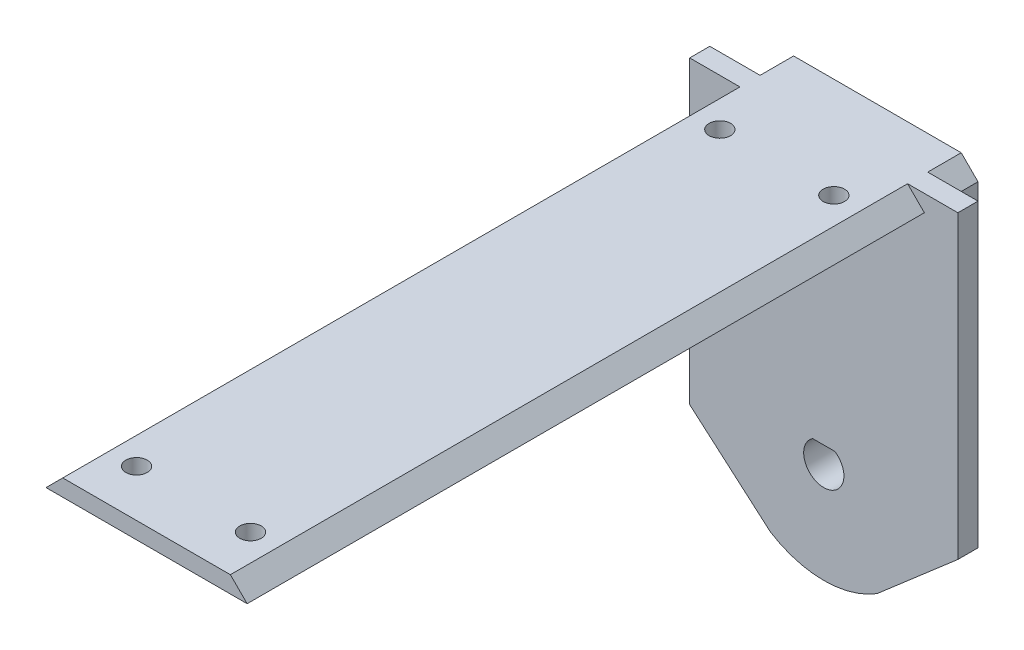
ISO-10303-21;
HEADER;
FILE_DESCRIPTION(('STEP AP214'),'2;1');
FILE_NAME('part.step','',(''),(''),'','','');
FILE_SCHEMA(('AUTOMOTIVE_DESIGN { 1 0 10303 214 1 1 1 1 }'));
ENDSEC;
DATA;
#1=APPLICATION_CONTEXT('core data for automotive mechanical design processes');
#2=APPLICATION_PROTOCOL_DEFINITION('international standard','automotive_design',2000,#1);
#3=PRODUCT_CONTEXT('',#1,'mechanical');
#4=PRODUCT('Part','Part','',(#3));
#5=PRODUCT_RELATED_PRODUCT_CATEGORY('part','',(#4));
#6=PRODUCT_DEFINITION_FORMATION('','',#4);
#7=PRODUCT_DEFINITION_CONTEXT('part definition',#1,'design');
#8=PRODUCT_DEFINITION('design','',#6,#7);
#9=PRODUCT_DEFINITION_SHAPE('','',#8);
#10=(LENGTH_UNIT() NAMED_UNIT(*) SI_UNIT(.MILLI.,.METRE.));
#11=(NAMED_UNIT(*) PLANE_ANGLE_UNIT() SI_UNIT($,.RADIAN.));
#12=(NAMED_UNIT(*) SI_UNIT($,.STERADIAN.) SOLID_ANGLE_UNIT());
#13=UNCERTAINTY_MEASURE_WITH_UNIT(LENGTH_MEASURE(1.E-05),#10,'distance_accuracy_value','');
#14=(GEOMETRIC_REPRESENTATION_CONTEXT(3) GLOBAL_UNCERTAINTY_ASSIGNED_CONTEXT((#13)) GLOBAL_UNIT_ASSIGNED_CONTEXT((#10,
#11,#12)) REPRESENTATION_CONTEXT('',''));
#15=CARTESIAN_POINT('',(0.,0.,0.));
#16=DIRECTION('',(0.,0.,1.));
#17=DIRECTION('',(1.,0.,0.));
#18=AXIS2_PLACEMENT_3D('',#15,#16,#17);
#19=CARTESIAN_POINT('',(0.,-7.,8.));
#20=DIRECTION('',(0.,0.,-1.));
#21=DIRECTION('',(-1.,0.,0.));
#22=AXIS2_PLACEMENT_3D('',#19,#20,#21);
#23=CYLINDRICAL_SURFACE('',#22,10.);
#24=DIRECTION('',(0.,0.,-1.));
#25=VECTOR('',#24,1.);
#26=CARTESIAN_POINT('',(5.,-15.6602540378444,8.));
#27=LINE('',#26,#25);
#28=CARTESIAN_POINT('',(5.,-15.6602540378444,5.));
#29=VERTEX_POINT('',#28);
#30=CARTESIAN_POINT('',(5.,-15.6602540378444,0.));
#31=VERTEX_POINT('',#30);
#32=EDGE_CURVE('E93',#29,#31,#27,.T.);
#33=ORIENTED_EDGE('',*,*,#32,.F.);
#34=CARTESIAN_POINT('',(0.,-7.,5.));
#35=DIRECTION('',(0.,0.,1.));
#36=DIRECTION('',(1.,0.,0.));
#37=AXIS2_PLACEMENT_3D('',#34,#35,#36);
#38=CIRCLE('',#37,10.);
#39=CARTESIAN_POINT('',(-5.,-15.6602540378444,5.));
#40=VERTEX_POINT('',#39);
#41=EDGE_CURVE('E320',#29,#40,#38,.F.);
#42=ORIENTED_EDGE('',*,*,#41,.T.);
#43=DIRECTION('',(0.,0.,-1.));
#44=VECTOR('',#43,1.);
#45=CARTESIAN_POINT('',(-5.,-15.6602540378444,8.));
#46=LINE('',#45,#44);
#47=CARTESIAN_POINT('',(-5.,-15.6602540378444,0.));
#48=VERTEX_POINT('',#47);
#49=EDGE_CURVE('E108',#40,#48,#46,.T.);
#50=ORIENTED_EDGE('',*,*,#49,.T.);
#51=CARTESIAN_POINT('',(0.,-7.,0.));
#52=DIRECTION('',(0.,0.,1.));
#53=DIRECTION('',(1.,0.,0.));
#54=AXIS2_PLACEMENT_3D('',#51,#52,#53);
#55=CIRCLE('',#54,10.);
#56=EDGE_CURVE('E127',#31,#48,#55,.F.);
#57=ORIENTED_EDGE('',*,*,#56,.F.);
#58=EDGE_LOOP('',(#33,#42,#50,#57));
#59=FACE_BOUND('',#58,.T.);
#60=ADVANCED_FACE('F36',(#59),#23,.T.);
#61=CARTESIAN_POINT('',(9.89267304370918,-11.4230748895809,8.));
#62=DIRECTION('',(0.654653670707977,-0.755928946018455,0.));
#63=DIRECTION('',(0.755928946018455,0.654653670707977,0.));
#64=AXIS2_PLACEMENT_3D('',#61,#62,#63);
#65=PLANE('',#64);
#66=DIRECTION('',(0.,0.,-1.));
#67=VECTOR('',#66,1.);
#68=CARTESIAN_POINT('',(15.,-7.,8.));
#69=LINE('',#68,#67);
#70=CARTESIAN_POINT('',(15.,-7.,5.));
#71=VERTEX_POINT('',#70);
#72=CARTESIAN_POINT('',(15.,-7.,0.));
#73=VERTEX_POINT('',#72);
#74=EDGE_CURVE('E113',#71,#73,#69,.T.);
#75=ORIENTED_EDGE('',*,*,#74,.F.);
#76=DIRECTION('',(-0.755928946018455,-0.654653670707977,0.));
#77=VECTOR('',#76,1.);
#78=CARTESIAN_POINT('',(9.89267304370918,-11.4230748895809,5.));
#79=LINE('',#78,#77);
#80=EDGE_CURVE('E254',#71,#29,#79,.T.);
#81=ORIENTED_EDGE('',*,*,#80,.T.);
#82=ORIENTED_EDGE('',*,*,#32,.T.);
#83=DIRECTION('',(-0.755928946018455,-0.654653670707977,0.));
#84=VECTOR('',#83,1.);
#85=CARTESIAN_POINT('',(9.89267304370918,-11.4230748895809,0.));
#86=LINE('',#85,#84);
#87=EDGE_CURVE('E130',#73,#31,#86,.T.);
#88=ORIENTED_EDGE('',*,*,#87,.F.);
#89=EDGE_LOOP('',(#75,#81,#82,#88));
#90=FACE_BOUND('',#89,.T.);
#91=ADVANCED_FACE('F251',(#90),#65,.T.);
#92=CARTESIAN_POINT('',(15.,0.,8.));
#93=DIRECTION('',(-1.,0.,0.));
#94=DIRECTION('',(0.,0.,1.));
#95=AXIS2_PLACEMENT_3D('',#92,#93,#94);
#96=PLANE('',#95);
#97=DIRECTION('',(0.,1.,0.));
#98=VECTOR('',#97,1.);
#99=CARTESIAN_POINT('',(15.,0.,5.));
#100=LINE('',#99,#98);
#101=CARTESIAN_POINT('',(15.,33.,5.));
#102=VERTEX_POINT('',#101);
#103=EDGE_CURVE('E248',#71,#102,#100,.T.);
#104=ORIENTED_EDGE('',*,*,#103,.F.);
#105=ORIENTED_EDGE('',*,*,#74,.T.);
#106=DIRECTION('',(0.,1.,0.));
#107=VECTOR('',#106,1.);
#108=CARTESIAN_POINT('',(15.,0.,0.));
#109=LINE('',#108,#107);
#110=CARTESIAN_POINT('',(15.,33.,0.));
#111=VERTEX_POINT('',#110);
#112=EDGE_CURVE('E134',#73,#111,#109,.T.);
#113=ORIENTED_EDGE('',*,*,#112,.T.);
#114=DIRECTION('',(0.,0.,-1.));
#115=VECTOR('',#114,1.);
#116=CARTESIAN_POINT('',(15.,33.,8.));
#117=LINE('',#116,#115);
#118=EDGE_CURVE('E115',#102,#111,#117,.T.);
#119=ORIENTED_EDGE('',*,*,#118,.F.);
#120=EDGE_LOOP('',(#104,#105,#113,#119));
#121=FACE_BOUND('',#120,.T.);
#122=ADVANCED_FACE('F244',(#121),#96,.F.);
#123=CARTESIAN_POINT('',(-15.,0.,8.));
#124=DIRECTION('',(-1.,0.,0.));
#125=DIRECTION('',(0.,0.,1.));
#126=AXIS2_PLACEMENT_3D('',#123,#124,#125);
#127=PLANE('',#126);
#128=DIRECTION('',(0.,0.,-1.));
#129=VECTOR('',#128,1.);
#130=CARTESIAN_POINT('',(-15.,-7.,8.));
#131=LINE('',#130,#129);
#132=CARTESIAN_POINT('',(-15.,-7.,5.));
#133=VERTEX_POINT('',#132);
#134=CARTESIAN_POINT('',(-15.,-7.,0.));
#135=VERTEX_POINT('',#134);
#136=EDGE_CURVE('E110',#133,#135,#131,.T.);
#137=ORIENTED_EDGE('',*,*,#136,.F.);
#138=DIRECTION('',(0.,1.,0.));
#139=VECTOR('',#138,1.);
#140=CARTESIAN_POINT('',(-15.,0.,5.));
#141=LINE('',#140,#139);
#142=CARTESIAN_POINT('',(-15.,33.,5.));
#143=VERTEX_POINT('',#142);
#144=EDGE_CURVE('E163',#133,#143,#141,.T.);
#145=ORIENTED_EDGE('',*,*,#144,.T.);
#146=DIRECTION('',(0.,0.,-1.));
#147=VECTOR('',#146,1.);
#148=CARTESIAN_POINT('',(-15.,33.,8.));
#149=LINE('',#148,#147);
#150=CARTESIAN_POINT('',(-15.,33.,0.));
#151=VERTEX_POINT('',#150);
#152=EDGE_CURVE('E39',#143,#151,#149,.T.);
#153=ORIENTED_EDGE('',*,*,#152,.T.);
#154=DIRECTION('',(0.,1.,0.));
#155=VECTOR('',#154,1.);
#156=CARTESIAN_POINT('',(-15.,0.,0.));
#157=LINE('',#156,#155);
#158=EDGE_CURVE('E137',#135,#151,#157,.T.);
#159=ORIENTED_EDGE('',*,*,#158,.F.);
#160=EDGE_LOOP('',(#137,#145,#153,#159));
#161=FACE_BOUND('',#160,.T.);
#162=ADVANCED_FACE('F158',(#161),#127,.T.);
#163=CARTESIAN_POINT('',(-9.89267304370918,-11.4230748895809,8.));
#164=DIRECTION('',(-0.654653670707977,-0.755928946018455,0.));
#165=DIRECTION('',(0.755928946018455,-0.654653670707977,0.));
#166=AXIS2_PLACEMENT_3D('',#163,#164,#165);
#167=PLANE('',#166);
#168=ORIENTED_EDGE('',*,*,#49,.F.);
#169=DIRECTION('',(-0.755928946018455,0.654653670707977,0.));
#170=VECTOR('',#169,1.);
#171=CARTESIAN_POINT('',(-9.89267304370918,-11.4230748895809,5.));
#172=LINE('',#171,#170);
#173=EDGE_CURVE('E154',#40,#133,#172,.T.);
#174=ORIENTED_EDGE('',*,*,#173,.T.);
#175=ORIENTED_EDGE('',*,*,#136,.T.);
#176=DIRECTION('',(-0.755928946018455,0.654653670707977,0.));
#177=VECTOR('',#176,1.);
#178=CARTESIAN_POINT('',(-9.89267304370918,-11.4230748895809,0.));
#179=LINE('',#178,#177);
#180=EDGE_CURVE('E98',#48,#135,#179,.T.);
#181=ORIENTED_EDGE('',*,*,#180,.F.);
#182=EDGE_LOOP('',(#168,#174,#175,#181));
#183=FACE_BOUND('',#182,.T.);
#184=ADVANCED_FACE('F148',(#183),#167,.T.);
#185=CARTESIAN_POINT('',(-24.,23.9999999999999,109.));
#186=DIRECTION('',(-0.70710678118655,0.707106781186545,0.));
#187=DIRECTION('',(-0.707106781186545,-0.70710678118655,0.));
#188=AXIS2_PLACEMENT_3D('',#185,#186,#187);
#189=PLANE('',#188);
#190=ORIENTED_EDGE('',*,*,#152,.F.);
#191=DIRECTION('',(0.707106781186545,0.70710678118655,0.));
#192=VECTOR('',#191,1.);
#193=CARTESIAN_POINT('',(-24.,23.9999999999999,5.));
#194=LINE('',#193,#192);
#195=CARTESIAN_POINT('',(-12.5,35.5,5.));
#196=VERTEX_POINT('',#195);
#197=EDGE_CURVE('E316',#143,#196,#194,.T.);
#198=ORIENTED_EDGE('',*,*,#197,.T.);
#199=DIRECTION('',(0.,0.,-1.));
#200=VECTOR('',#199,1.);
#201=CARTESIAN_POINT('',(-12.5,35.5,109.));
#202=LINE('',#201,#200);
#203=CARTESIAN_POINT('',(-12.5,35.5,0.));
#204=VERTEX_POINT('',#203);
#205=EDGE_CURVE('E173',#196,#204,#202,.T.);
#206=ORIENTED_EDGE('',*,*,#205,.T.);
#207=DIRECTION('',(0.707106781186545,0.70710678118655,0.));
#208=VECTOR('',#207,1.);
#209=CARTESIAN_POINT('',(-24.,23.9999999999999,0.));
#210=LINE('',#209,#208);
#211=EDGE_CURVE('E170',#151,#204,#210,.T.);
#212=ORIENTED_EDGE('',*,*,#211,.F.);
#213=EDGE_LOOP('',(#190,#198,#206,#212));
#214=FACE_BOUND('',#213,.T.);
#215=ADVANCED_FACE('F171',(#214),#189,.T.);
#216=CARTESIAN_POINT('',(23.9999999999999,24.0000000000002,109.));
#217=DIRECTION('',(-0.707106781186543,-0.707106781186552,0.));
#218=DIRECTION('',(0.707106781186552,-0.707106781186543,0.));
#219=AXIS2_PLACEMENT_3D('',#216,#217,#218);
#220=PLANE('',#219);
#221=DIRECTION('',(-0.707106781186552,0.707106781186543,0.));
#222=VECTOR('',#221,1.);
#223=CARTESIAN_POINT('',(23.9999999999999,24.0000000000002,5.));
#224=LINE('',#223,#222);
#225=CARTESIAN_POINT('',(12.5,35.5,5.));
#226=VERTEX_POINT('',#225);
#227=EDGE_CURVE('E11',#102,#226,#224,.T.);
#228=ORIENTED_EDGE('',*,*,#227,.F.);
#229=ORIENTED_EDGE('',*,*,#118,.T.);
#230=DIRECTION('',(-0.707106781186552,0.707106781186543,0.));
#231=VECTOR('',#230,1.);
#232=CARTESIAN_POINT('',(23.9999999999999,24.0000000000002,0.));
#233=LINE('',#232,#231);
#234=CARTESIAN_POINT('',(12.5,35.5,0.));
#235=VERTEX_POINT('',#234);
#236=EDGE_CURVE('E176',#111,#235,#233,.T.);
#237=ORIENTED_EDGE('',*,*,#236,.T.);
#238=DIRECTION('',(0.,0.,-1.));
#239=VECTOR('',#238,1.);
#240=CARTESIAN_POINT('',(12.5,35.5,109.));
#241=LINE('',#240,#239);
#242=EDGE_CURVE('E190',#226,#235,#241,.T.);
#243=ORIENTED_EDGE('',*,*,#242,.F.);
#244=EDGE_LOOP('',(#228,#229,#237,#243));
#245=FACE_BOUND('',#244,.T.);
#246=ADVANCED_FACE('F235',(#245),#220,.F.);
#247=CARTESIAN_POINT('',(0.,-7.,8.));
#248=DIRECTION('',(0.,0.,-1.));
#249=DIRECTION('',(-1.,0.,0.));
#250=AXIS2_PLACEMENT_3D('',#247,#248,#249);
#251=CYLINDRICAL_SURFACE('',#250,3.);
#252=DIRECTION('',(0.,0.,-1.));
#253=VECTOR('',#252,1.);
#254=CARTESIAN_POINT('',(1.6583123951777,-4.5,8.));
#255=LINE('',#254,#253);
#256=CARTESIAN_POINT('',(1.6583123951777,-4.5,8.));
#257=VERTEX_POINT('',#256);
#258=CARTESIAN_POINT('',(1.6583123951777,-4.5,0.));
#259=VERTEX_POINT('',#258);
#260=EDGE_CURVE('E61',#257,#259,#255,.T.);
#261=ORIENTED_EDGE('',*,*,#260,.T.);
#262=CARTESIAN_POINT('',(0.,-7.,0.));
#263=DIRECTION('',(0.,0.,1.));
#264=DIRECTION('',(1.,0.,0.));
#265=AXIS2_PLACEMENT_3D('',#262,#263,#264);
#266=CIRCLE('',#265,3.);
#267=CARTESIAN_POINT('',(-1.6583123951777,-4.5,0.));
#268=VERTEX_POINT('',#267);
#269=EDGE_CURVE('E87',#268,#259,#266,.T.);
#270=ORIENTED_EDGE('',*,*,#269,.F.);
#271=DIRECTION('',(0.,0.,-1.));
#272=VECTOR('',#271,1.);
#273=CARTESIAN_POINT('',(-1.6583123951777,-4.5,8.));
#274=LINE('',#273,#272);
#275=CARTESIAN_POINT('',(-1.6583123951777,-4.5,8.));
#276=VERTEX_POINT('',#275);
#277=EDGE_CURVE('E92',#276,#268,#274,.T.);
#278=ORIENTED_EDGE('',*,*,#277,.F.);
#279=CARTESIAN_POINT('',(0.,-7.,8.));
#280=DIRECTION('',(0.,0.,1.));
#281=DIRECTION('',(1.,0.,0.));
#282=AXIS2_PLACEMENT_3D('',#279,#280,#281);
#283=CIRCLE('',#282,3.);
#284=EDGE_CURVE('E90',#276,#257,#283,.T.);
#285=ORIENTED_EDGE('',*,*,#284,.T.);
#286=EDGE_LOOP('',(#261,#270,#278,#285));
#287=FACE_BOUND('',#286,.T.);
#288=ADVANCED_FACE('F86',(#287),#251,.F.);
#289=CARTESIAN_POINT('',(0.,-4.5,8.));
#290=DIRECTION('',(0.,-1.,0.));
#291=DIRECTION('',(0.,0.,-1.));
#292=AXIS2_PLACEMENT_3D('',#289,#290,#291);
#293=PLANE('',#292);
#294=ORIENTED_EDGE('',*,*,#277,.T.);
#295=DIRECTION('',(-1.,0.,0.));
#296=VECTOR('',#295,1.);
#297=CARTESIAN_POINT('',(0.,-4.5,0.));
#298=LINE('',#297,#296);
#299=EDGE_CURVE('E97',#259,#268,#298,.T.);
#300=ORIENTED_EDGE('',*,*,#299,.F.);
#301=ORIENTED_EDGE('',*,*,#260,.F.);
#302=DIRECTION('',(-1.,0.,0.));
#303=VECTOR('',#302,1.);
#304=CARTESIAN_POINT('',(0.,-4.5,8.));
#305=LINE('',#304,#303);
#306=EDGE_CURVE('E111',#257,#276,#305,.T.);
#307=ORIENTED_EDGE('',*,*,#306,.T.);
#308=EDGE_LOOP('',(#294,#300,#301,#307));
#309=FACE_BOUND('',#308,.T.);
#310=ADVANCED_FACE('F100',(#309),#293,.T.);
#311=CARTESIAN_POINT('',(0.,0.,8.));
#312=DIRECTION('',(0.,0.,1.));
#313=DIRECTION('',(1.,0.,0.));
#314=AXIS2_PLACEMENT_3D('',#311,#312,#313);
#315=PLANE('',#314);
#316=DIRECTION('',(-0.707106781186552,0.707106781186543,0.));
#317=VECTOR('',#316,1.);
#318=CARTESIAN_POINT('',(23.9999999999999,24.0000000000002,7.99999999999999));
#319=LINE('',#318,#317);
#320=CARTESIAN_POINT('',(15.,33.,7.99999999999999));
#321=VERTEX_POINT('',#320);
#322=CARTESIAN_POINT('',(12.5,35.5,7.99999999999999));
#323=VERTEX_POINT('',#322);
#324=EDGE_CURVE('E45',#321,#323,#319,.T.);
#325=ORIENTED_EDGE('',*,*,#324,.F.);
#326=DIRECTION('',(-1.,0.,0.));
#327=VECTOR('',#326,1.);
#328=CARTESIAN_POINT('',(0.,33.,8.));
#329=LINE('',#328,#327);
#330=CARTESIAN_POINT('',(-15.,33.,7.99999999999999));
#331=VERTEX_POINT('',#330);
#332=EDGE_CURVE('E101',#321,#331,#329,.T.);
#333=ORIENTED_EDGE('',*,*,#332,.T.);
#334=DIRECTION('',(0.707106781186545,0.70710678118655,0.));
#335=VECTOR('',#334,1.);
#336=CARTESIAN_POINT('',(-24.,23.9999999999999,7.99999999999999));
#337=LINE('',#336,#335);
#338=CARTESIAN_POINT('',(-12.5,35.5,8.));
#339=VERTEX_POINT('',#338);
#340=EDGE_CURVE('E220',#331,#339,#337,.T.);
#341=ORIENTED_EDGE('',*,*,#340,.T.);
#342=DIRECTION('',(-1.,0.,0.));
#343=VECTOR('',#342,1.);
#344=CARTESIAN_POINT('',(-20.,35.5,8.));
#345=LINE('',#344,#343);
#346=CARTESIAN_POINT('',(-20.,35.5,8.));
#347=VERTEX_POINT('',#346);
#348=EDGE_CURVE('E363',#339,#347,#345,.T.);
#349=ORIENTED_EDGE('',*,*,#348,.T.);
#350=DIRECTION('',(0.,-1.,0.));
#351=VECTOR('',#350,1.);
#352=CARTESIAN_POINT('',(-20.,33.,8.));
#353=LINE('',#352,#351);
#354=CARTESIAN_POINT('',(-20.,-9.28425125873928,8.));
#355=VERTEX_POINT('',#354);
#356=EDGE_CURVE('E359',#347,#355,#353,.T.);
#357=ORIENTED_EDGE('',*,*,#356,.T.);
#358=DIRECTION('',(0.755928946018455,-0.654653670707977,0.));
#359=VECTOR('',#358,1.);
#360=CARTESIAN_POINT('',(-20.,-9.28425125873928,8.));
#361=LINE('',#360,#359);
#362=CARTESIAN_POINT('',(-7.94955507510212,-19.7202426906061,8.));
#363=VERTEX_POINT('',#362);
#364=EDGE_CURVE('E356',#355,#363,#361,.T.);
#365=ORIENTED_EDGE('',*,*,#364,.T.);
#366=CARTESIAN_POINT('',(0.,-7.,8.));
#367=DIRECTION('',(0.,0.,1.));
#368=DIRECTION('',(1.,0.,0.));
#369=AXIS2_PLACEMENT_3D('',#366,#367,#368);
#370=CIRCLE('',#369,15.);
#371=CARTESIAN_POINT('',(7.9495550751021,-19.7202426906061,8.));
#372=VERTEX_POINT('',#371);
#373=EDGE_CURVE('E353',#363,#372,#370,.T.);
#374=ORIENTED_EDGE('',*,*,#373,.T.);
#375=DIRECTION('',(0.755928946018455,0.654653670707977,0.));
#376=VECTOR('',#375,1.);
#377=CARTESIAN_POINT('',(7.9495550751021,-19.7202426906061,8.));
#378=LINE('',#377,#376);
#379=CARTESIAN_POINT('',(20.,-9.28425125873929,8.));
#380=VERTEX_POINT('',#379);
#381=EDGE_CURVE('E350',#372,#380,#378,.T.);
#382=ORIENTED_EDGE('',*,*,#381,.T.);
#383=DIRECTION('',(0.,1.,0.));
#384=VECTOR('',#383,1.);
#385=CARTESIAN_POINT('',(20.,-9.28425125873929,8.));
#386=LINE('',#385,#384);
#387=CARTESIAN_POINT('',(20.,35.5,8.));
#388=VERTEX_POINT('',#387);
#389=EDGE_CURVE('E347',#380,#388,#386,.T.);
#390=ORIENTED_EDGE('',*,*,#389,.T.);
#391=EDGE_CURVE('E52',#388,#323,#345,.T.);
#392=ORIENTED_EDGE('',*,*,#391,.T.);
#393=EDGE_LOOP('',(#325,#333,#341,#349,#357,#365,#374,#382,#390,#392));
#394=FACE_BOUND('',#393,.T.);
#395=ORIENTED_EDGE('',*,*,#284,.F.);
#396=ORIENTED_EDGE('',*,*,#306,.F.);
#397=EDGE_LOOP('',(#395,#396));
#398=FACE_BOUND('',#397,.T.);
#399=ADVANCED_FACE('F217',(#394,#398),#315,.T.);
#400=CARTESIAN_POINT('',(0.,0.,0.));
#401=DIRECTION('',(0.,0.,1.));
#402=DIRECTION('',(1.,0.,0.));
#403=AXIS2_PLACEMENT_3D('',#400,#401,#402);
#404=PLANE('',#403);
#405=ORIENTED_EDGE('',*,*,#56,.T.);
#406=ORIENTED_EDGE('',*,*,#180,.T.);
#407=ORIENTED_EDGE('',*,*,#158,.T.);
#408=ORIENTED_EDGE('',*,*,#211,.T.);
#409=DIRECTION('',(1.,0.,0.));
#410=VECTOR('',#409,1.);
#411=CARTESIAN_POINT('',(0.,35.5,0.));
#412=LINE('',#411,#410);
#413=EDGE_CURVE('E177',#204,#235,#412,.T.);
#414=ORIENTED_EDGE('',*,*,#413,.T.);
#415=ORIENTED_EDGE('',*,*,#236,.F.);
#416=ORIENTED_EDGE('',*,*,#112,.F.);
#417=ORIENTED_EDGE('',*,*,#87,.T.);
#418=EDGE_LOOP('',(#405,#406,#407,#408,#414,#415,#416,#417));
#419=FACE_BOUND('',#418,.T.);
#420=ORIENTED_EDGE('',*,*,#269,.T.);
#421=ORIENTED_EDGE('',*,*,#299,.T.);
#422=EDGE_LOOP('',(#420,#421));
#423=FACE_BOUND('',#422,.T.);
#424=ADVANCED_FACE('F96',(#419,#423),#404,.F.);
#425=CARTESIAN_POINT('',(0.,33.,109.));
#426=DIRECTION('',(0.,-1.,0.));
#427=DIRECTION('',(0.,0.,-1.));
#428=AXIS2_PLACEMENT_3D('',#425,#426,#427);
#429=PLANE('',#428);
#430=CARTESIAN_POINT('',(-8.50000000000001,33.,15.));
#431=DIRECTION('',(0.,-1.,0.));
#432=DIRECTION('',(0.,0.,-1.));
#433=AXIS2_PLACEMENT_3D('',#430,#431,#432);
#434=CIRCLE('',#433,1.59999999999999);
#435=CARTESIAN_POINT('',(-8.50000000000001,33.,13.4));
#436=VERTEX_POINT('',#435);
#437=EDGE_CURVE('E310',#436,#436,#434,.T.);
#438=ORIENTED_EDGE('',*,*,#437,.F.);
#439=EDGE_LOOP('',(#438));
#440=FACE_BOUND('',#439,.T.);
#441=CARTESIAN_POINT('',(8.49999999999998,33.,15.));
#442=DIRECTION('',(0.,-1.,0.));
#443=DIRECTION('',(0.,0.,-1.));
#444=AXIS2_PLACEMENT_3D('',#441,#442,#443);
#445=CIRCLE('',#444,1.59999999999999);
#446=CARTESIAN_POINT('',(8.49999999999998,33.,13.4));
#447=VERTEX_POINT('',#446);
#448=EDGE_CURVE('E304',#447,#447,#445,.T.);
#449=ORIENTED_EDGE('',*,*,#448,.F.);
#450=EDGE_LOOP('',(#449));
#451=FACE_BOUND('',#450,.T.);
#452=CARTESIAN_POINT('',(-8.5,33.,102.));
#453=DIRECTION('',(0.,-1.,0.));
#454=DIRECTION('',(0.,0.,-1.));
#455=AXIS2_PLACEMENT_3D('',#452,#453,#454);
#456=CIRCLE('',#455,1.59999999999999);
#457=CARTESIAN_POINT('',(-8.5,33.,100.4));
#458=VERTEX_POINT('',#457);
#459=EDGE_CURVE('E298',#458,#458,#456,.T.);
#460=ORIENTED_EDGE('',*,*,#459,.F.);
#461=EDGE_LOOP('',(#460));
#462=FACE_BOUND('',#461,.T.);
#463=CARTESIAN_POINT('',(8.49999999999998,33.,102.));
#464=DIRECTION('',(0.,-1.,0.));
#465=DIRECTION('',(0.,0.,-1.));
#466=AXIS2_PLACEMENT_3D('',#463,#464,#465);
#467=CIRCLE('',#466,1.59999999999999);
#468=CARTESIAN_POINT('',(8.49999999999998,33.,100.4));
#469=VERTEX_POINT('',#468);
#470=EDGE_CURVE('E182',#469,#469,#467,.T.);
#471=ORIENTED_EDGE('',*,*,#470,.F.);
#472=EDGE_LOOP('',(#471));
#473=FACE_BOUND('',#472,.T.);
#474=ORIENTED_EDGE('',*,*,#332,.F.);
#475=DIRECTION('',(0.,0.,-1.));
#476=VECTOR('',#475,1.);
#477=CARTESIAN_POINT('',(15.,33.,109.));
#478=LINE('',#477,#476);
#479=CARTESIAN_POINT('',(15.,33.,109.));
#480=VERTEX_POINT('',#479);
#481=EDGE_CURVE('E189',#480,#321,#478,.T.);
#482=ORIENTED_EDGE('',*,*,#481,.F.);
#483=DIRECTION('',(-1.,0.,0.));
#484=VECTOR('',#483,1.);
#485=CARTESIAN_POINT('',(0.,33.,109.));
#486=LINE('',#485,#484);
#487=CARTESIAN_POINT('',(-15.,33.,109.));
#488=VERTEX_POINT('',#487);
#489=EDGE_CURVE('E212',#480,#488,#486,.T.);
#490=ORIENTED_EDGE('',*,*,#489,.T.);
#491=DIRECTION('',(0.,0.,-1.));
#492=VECTOR('',#491,1.);
#493=CARTESIAN_POINT('',(-15.,33.,109.));
#494=LINE('',#493,#492);
#495=EDGE_CURVE('E122',#488,#331,#494,.T.);
#496=ORIENTED_EDGE('',*,*,#495,.T.);
#497=EDGE_LOOP('',(#474,#482,#490,#496));
#498=FACE_BOUND('',#497,.T.);
#499=ADVANCED_FACE('F207',(#440,#451,#462,#473,#498),#429,.T.);
#500=CARTESIAN_POINT('',(0.,35.5,109.));
#501=DIRECTION('',(0.,1.,0.));
#502=DIRECTION('',(0.,0.,1.));
#503=AXIS2_PLACEMENT_3D('',#500,#501,#502);
#504=PLANE('',#503);
#505=CARTESIAN_POINT('',(12.5,35.5,109.));
#506=VERTEX_POINT('',#505);
#507=EDGE_CURVE('E186',#506,#323,#241,.T.);
#508=ORIENTED_EDGE('',*,*,#507,.T.);
#509=ORIENTED_EDGE('',*,*,#391,.F.);
#510=DIRECTION('',(0.,0.,1.));
#511=VECTOR('',#510,1.);
#512=CARTESIAN_POINT('',(20.,35.5,5.));
#513=LINE('',#512,#511);
#514=CARTESIAN_POINT('',(20.,35.5,5.));
#515=VERTEX_POINT('',#514);
#516=EDGE_CURVE('E329',#515,#388,#513,.T.);
#517=ORIENTED_EDGE('',*,*,#516,.F.);
#518=DIRECTION('',(-1.,0.,0.));
#519=VECTOR('',#518,1.);
#520=CARTESIAN_POINT('',(-20.,35.5,5.));
#521=LINE('',#520,#519);
#522=EDGE_CURVE('E282',#515,#226,#521,.T.);
#523=ORIENTED_EDGE('',*,*,#522,.T.);
#524=ORIENTED_EDGE('',*,*,#242,.T.);
#525=ORIENTED_EDGE('',*,*,#413,.F.);
#526=ORIENTED_EDGE('',*,*,#205,.F.);
#527=CARTESIAN_POINT('',(-20.,35.5,5.));
#528=VERTEX_POINT('',#527);
#529=EDGE_CURVE('E376',#196,#528,#521,.T.);
#530=ORIENTED_EDGE('',*,*,#529,.T.);
#531=DIRECTION('',(0.,0.,1.));
#532=VECTOR('',#531,1.);
#533=CARTESIAN_POINT('',(-20.,35.5,5.));
#534=LINE('',#533,#532);
#535=EDGE_CURVE('E332',#528,#347,#534,.T.);
#536=ORIENTED_EDGE('',*,*,#535,.T.);
#537=ORIENTED_EDGE('',*,*,#348,.F.);
#538=CARTESIAN_POINT('',(-12.5,35.5,109.));
#539=VERTEX_POINT('',#538);
#540=EDGE_CURVE('E131',#539,#339,#202,.T.);
#541=ORIENTED_EDGE('',*,*,#540,.F.);
#542=DIRECTION('',(1.,0.,0.));
#543=VECTOR('',#542,1.);
#544=CARTESIAN_POINT('',(0.,35.5,109.));
#545=LINE('',#544,#543);
#546=EDGE_CURVE('E180',#539,#506,#545,.T.);
#547=ORIENTED_EDGE('',*,*,#546,.T.);
#548=EDGE_LOOP('',(#508,#509,#517,#523,#524,#525,#526,#530,#536,#537,#541,#547));
#549=FACE_BOUND('',#548,.T.);
#550=CARTESIAN_POINT('',(-8.50000000000001,35.5,15.));
#551=DIRECTION('',(0.,1.,0.));
#552=DIRECTION('',(0.,0.,1.));
#553=AXIS2_PLACEMENT_3D('',#550,#551,#552);
#554=CIRCLE('',#553,1.59999999999999);
#555=CARTESIAN_POINT('',(-8.50000000000001,35.5,16.6));
#556=VERTEX_POINT('',#555);
#557=EDGE_CURVE('E313',#556,#556,#554,.T.);
#558=ORIENTED_EDGE('',*,*,#557,.F.);
#559=EDGE_LOOP('',(#558));
#560=FACE_BOUND('',#559,.T.);
#561=CARTESIAN_POINT('',(8.49999999999998,35.5,15.));
#562=DIRECTION('',(0.,1.,0.));
#563=DIRECTION('',(0.,0.,1.));
#564=AXIS2_PLACEMENT_3D('',#561,#562,#563);
#565=CIRCLE('',#564,1.59999999999999);
#566=CARTESIAN_POINT('',(8.49999999999998,35.5,16.6));
#567=VERTEX_POINT('',#566);
#568=EDGE_CURVE('E307',#567,#567,#565,.T.);
#569=ORIENTED_EDGE('',*,*,#568,.F.);
#570=EDGE_LOOP('',(#569));
#571=FACE_BOUND('',#570,.T.);
#572=CARTESIAN_POINT('',(-8.5,35.5,102.));
#573=DIRECTION('',(0.,1.,0.));
#574=DIRECTION('',(0.,0.,1.));
#575=AXIS2_PLACEMENT_3D('',#572,#573,#574);
#576=CIRCLE('',#575,1.59999999999999);
#577=CARTESIAN_POINT('',(-8.5,35.5,103.6));
#578=VERTEX_POINT('',#577);
#579=EDGE_CURVE('E301',#578,#578,#576,.T.);
#580=ORIENTED_EDGE('',*,*,#579,.F.);
#581=EDGE_LOOP('',(#580));
#582=FACE_BOUND('',#581,.T.);
#583=CARTESIAN_POINT('',(8.49999999999998,35.5,102.));
#584=DIRECTION('',(0.,1.,0.));
#585=DIRECTION('',(0.,0.,1.));
#586=AXIS2_PLACEMENT_3D('',#583,#584,#585);
#587=CIRCLE('',#586,1.59999999999999);
#588=CARTESIAN_POINT('',(8.49999999999998,35.5,103.6));
#589=VERTEX_POINT('',#588);
#590=EDGE_CURVE('E295',#589,#589,#587,.T.);
#591=ORIENTED_EDGE('',*,*,#590,.F.);
#592=EDGE_LOOP('',(#591));
#593=FACE_BOUND('',#592,.T.);
#594=ADVANCED_FACE('F278',(#549,#560,#571,#582,#593),#504,.T.);
#595=ORIENTED_EDGE('',*,*,#340,.F.);
#596=ORIENTED_EDGE('',*,*,#495,.F.);
#597=DIRECTION('',(0.707106781186545,0.70710678118655,0.));
#598=VECTOR('',#597,1.);
#599=CARTESIAN_POINT('',(-24.,23.9999999999999,109.));
#600=LINE('',#599,#598);
#601=EDGE_CURVE('E287',#488,#539,#600,.T.);
#602=ORIENTED_EDGE('',*,*,#601,.T.);
#603=ORIENTED_EDGE('',*,*,#540,.T.);
#604=EDGE_LOOP('',(#595,#596,#602,#603));
#605=FACE_BOUND('',#604,.T.);
#606=ADVANCED_FACE('F433',(#605),#189,.T.);
#607=ORIENTED_EDGE('',*,*,#481,.T.);
#608=ORIENTED_EDGE('',*,*,#324,.T.);
#609=ORIENTED_EDGE('',*,*,#507,.F.);
#610=DIRECTION('',(-0.707106781186552,0.707106781186543,0.));
#611=VECTOR('',#610,1.);
#612=CARTESIAN_POINT('',(23.9999999999999,24.0000000000002,109.));
#613=LINE('',#612,#611);
#614=EDGE_CURVE('E283',#480,#506,#613,.T.);
#615=ORIENTED_EDGE('',*,*,#614,.F.);
#616=EDGE_LOOP('',(#607,#608,#609,#615));
#617=FACE_BOUND('',#616,.T.);
#618=ADVANCED_FACE('F435',(#617),#220,.F.);
#619=CARTESIAN_POINT('',(0.,0.,109.));
#620=DIRECTION('',(0.,0.,1.));
#621=DIRECTION('',(1.,0.,0.));
#622=AXIS2_PLACEMENT_3D('',#619,#620,#621);
#623=PLANE('',#622);
#624=ORIENTED_EDGE('',*,*,#546,.F.);
#625=ORIENTED_EDGE('',*,*,#601,.F.);
#626=ORIENTED_EDGE('',*,*,#489,.F.);
#627=ORIENTED_EDGE('',*,*,#614,.T.);
#628=EDGE_LOOP('',(#624,#625,#626,#627));
#629=FACE_BOUND('',#628,.T.);
#630=ADVANCED_FACE('F432',(#629),#623,.T.);
#631=CARTESIAN_POINT('',(8.49999999999998,35.5,102.));
#632=DIRECTION('',(0.,1.,0.));
#633=DIRECTION('',(0.,0.,1.));
#634=AXIS2_PLACEMENT_3D('',#631,#632,#633);
#635=CYLINDRICAL_SURFACE('',#634,1.59999999999999);
#636=ORIENTED_EDGE('',*,*,#470,.T.);
#637=EDGE_LOOP('',(#636));
#638=FACE_BOUND('',#637,.T.);
#639=ORIENTED_EDGE('',*,*,#590,.T.);
#640=EDGE_LOOP('',(#639));
#641=FACE_BOUND('',#640,.T.);
#642=ADVANCED_FACE('F564',(#638,#641),#635,.F.);
#643=CARTESIAN_POINT('',(-8.5,35.5,102.));
#644=DIRECTION('',(0.,1.,0.));
#645=DIRECTION('',(0.,0.,1.));
#646=AXIS2_PLACEMENT_3D('',#643,#644,#645);
#647=CYLINDRICAL_SURFACE('',#646,1.59999999999999);
#648=ORIENTED_EDGE('',*,*,#459,.T.);
#649=EDGE_LOOP('',(#648));
#650=FACE_BOUND('',#649,.T.);
#651=ORIENTED_EDGE('',*,*,#579,.T.);
#652=EDGE_LOOP('',(#651));
#653=FACE_BOUND('',#652,.T.);
#654=ADVANCED_FACE('F560',(#650,#653),#647,.F.);
#655=CARTESIAN_POINT('',(8.49999999999998,35.5,15.));
#656=DIRECTION('',(0.,1.,0.));
#657=DIRECTION('',(0.,0.,1.));
#658=AXIS2_PLACEMENT_3D('',#655,#656,#657);
#659=CYLINDRICAL_SURFACE('',#658,1.59999999999999);
#660=ORIENTED_EDGE('',*,*,#448,.T.);
#661=EDGE_LOOP('',(#660));
#662=FACE_BOUND('',#661,.T.);
#663=ORIENTED_EDGE('',*,*,#568,.T.);
#664=EDGE_LOOP('',(#663));
#665=FACE_BOUND('',#664,.T.);
#666=ADVANCED_FACE('F556',(#662,#665),#659,.F.);
#667=CARTESIAN_POINT('',(-8.50000000000001,35.5,15.));
#668=DIRECTION('',(0.,1.,0.));
#669=DIRECTION('',(0.,0.,1.));
#670=AXIS2_PLACEMENT_3D('',#667,#668,#669);
#671=CYLINDRICAL_SURFACE('',#670,1.59999999999999);
#672=ORIENTED_EDGE('',*,*,#437,.T.);
#673=EDGE_LOOP('',(#672));
#674=FACE_BOUND('',#673,.T.);
#675=ORIENTED_EDGE('',*,*,#557,.T.);
#676=EDGE_LOOP('',(#675));
#677=FACE_BOUND('',#676,.T.);
#678=ADVANCED_FACE('F508',(#674,#677),#671,.F.);
#679=CARTESIAN_POINT('',(20.,-9.28425125873929,5.));
#680=DIRECTION('',(1.,0.,0.));
#681=DIRECTION('',(0.,0.,-1.));
#682=AXIS2_PLACEMENT_3D('',#679,#680,#681);
#683=PLANE('',#682);
#684=ORIENTED_EDGE('',*,*,#389,.F.);
#685=DIRECTION('',(0.,0.,1.));
#686=VECTOR('',#685,1.);
#687=CARTESIAN_POINT('',(20.,-9.28425125873929,5.));
#688=LINE('',#687,#686);
#689=CARTESIAN_POINT('',(20.,-9.28425125873929,5.));
#690=VERTEX_POINT('',#689);
#691=EDGE_CURVE('E328',#690,#380,#688,.T.);
#692=ORIENTED_EDGE('',*,*,#691,.F.);
#693=DIRECTION('',(0.,1.,0.));
#694=VECTOR('',#693,1.);
#695=CARTESIAN_POINT('',(20.,35.5,5.));
#696=LINE('',#695,#694);
#697=EDGE_CURVE('E349',#690,#515,#696,.T.);
#698=ORIENTED_EDGE('',*,*,#697,.T.);
#699=ORIENTED_EDGE('',*,*,#516,.T.);
#700=EDGE_LOOP('',(#684,#692,#698,#699));
#701=FACE_BOUND('',#700,.T.);
#702=ADVANCED_FACE('F427',(#701),#683,.T.);
#703=CARTESIAN_POINT('',(7.9495550751021,-19.7202426906061,5.));
#704=DIRECTION('',(0.654653670707977,-0.755928946018455,0.));
#705=DIRECTION('',(0.755928946018455,0.654653670707977,0.));
#706=AXIS2_PLACEMENT_3D('',#703,#704,#705);
#707=PLANE('',#706);
#708=ORIENTED_EDGE('',*,*,#381,.F.);
#709=DIRECTION('',(0.,0.,1.));
#710=VECTOR('',#709,1.);
#711=CARTESIAN_POINT('',(7.9495550751021,-19.7202426906061,5.));
#712=LINE('',#711,#710);
#713=CARTESIAN_POINT('',(7.9495550751021,-19.7202426906061,5.));
#714=VERTEX_POINT('',#713);
#715=EDGE_CURVE('E342',#714,#372,#712,.T.);
#716=ORIENTED_EDGE('',*,*,#715,.F.);
#717=DIRECTION('',(0.755928946018455,0.654653670707977,0.));
#718=VECTOR('',#717,1.);
#719=CARTESIAN_POINT('',(7.9495550751021,-19.7202426906061,5.));
#720=LINE('',#719,#718);
#721=EDGE_CURVE('E333',#714,#690,#720,.T.);
#722=ORIENTED_EDGE('',*,*,#721,.T.);
#723=ORIENTED_EDGE('',*,*,#691,.T.);
#724=EDGE_LOOP('',(#708,#716,#722,#723));
#725=FACE_BOUND('',#724,.T.);
#726=ADVANCED_FACE('F430',(#725),#707,.T.);
#727=CARTESIAN_POINT('',(0.,-7.,5.));
#728=DIRECTION('',(0.,0.,1.));
#729=DIRECTION('',(1.,0.,0.));
#730=AXIS2_PLACEMENT_3D('',#727,#728,#729);
#731=CYLINDRICAL_SURFACE('',#730,15.);
#732=ORIENTED_EDGE('',*,*,#373,.F.);
#733=DIRECTION('',(0.,0.,1.));
#734=VECTOR('',#733,1.);
#735=CARTESIAN_POINT('',(-7.94955507510212,-19.7202426906061,5.));
#736=LINE('',#735,#734);
#737=CARTESIAN_POINT('',(-7.94955507510212,-19.7202426906061,5.));
#738=VERTEX_POINT('',#737);
#739=EDGE_CURVE('E339',#738,#363,#736,.T.);
#740=ORIENTED_EDGE('',*,*,#739,.F.);
#741=CARTESIAN_POINT('',(0.,-7.,5.));
#742=DIRECTION('',(0.,0.,1.));
#743=DIRECTION('',(1.,0.,0.));
#744=AXIS2_PLACEMENT_3D('',#741,#742,#743);
#745=CIRCLE('',#744,15.);
#746=EDGE_CURVE('E366',#738,#714,#745,.T.);
#747=ORIENTED_EDGE('',*,*,#746,.T.);
#748=ORIENTED_EDGE('',*,*,#715,.T.);
#749=EDGE_LOOP('',(#732,#740,#747,#748));
#750=FACE_BOUND('',#749,.T.);
#751=ADVANCED_FACE('F431',(#750),#731,.T.);
#752=CARTESIAN_POINT('',(-20.,-9.28425125873928,5.));
#753=DIRECTION('',(-0.654653670707977,-0.755928946018455,0.));
#754=DIRECTION('',(0.755928946018455,-0.654653670707977,0.));
#755=AXIS2_PLACEMENT_3D('',#752,#753,#754);
#756=PLANE('',#755);
#757=ORIENTED_EDGE('',*,*,#364,.F.);
#758=DIRECTION('',(0.,0.,1.));
#759=VECTOR('',#758,1.);
#760=CARTESIAN_POINT('',(-20.,-9.28425125873928,5.));
#761=LINE('',#760,#759);
#762=CARTESIAN_POINT('',(-20.,-9.28425125873928,5.));
#763=VERTEX_POINT('',#762);
#764=EDGE_CURVE('E336',#763,#355,#761,.T.);
#765=ORIENTED_EDGE('',*,*,#764,.F.);
#766=DIRECTION('',(0.755928946018455,-0.654653670707977,0.));
#767=VECTOR('',#766,1.);
#768=CARTESIAN_POINT('',(-20.,-9.28425125873928,5.));
#769=LINE('',#768,#767);
#770=EDGE_CURVE('E369',#763,#738,#769,.T.);
#771=ORIENTED_EDGE('',*,*,#770,.T.);
#772=ORIENTED_EDGE('',*,*,#739,.T.);
#773=EDGE_LOOP('',(#757,#765,#771,#772));
#774=FACE_BOUND('',#773,.T.);
#775=ADVANCED_FACE('F402',(#774),#756,.T.);
#776=CARTESIAN_POINT('',(-20.,33.,5.));
#777=DIRECTION('',(-1.,0.,0.));
#778=DIRECTION('',(0.,-1.,0.));
#779=AXIS2_PLACEMENT_3D('',#776,#777,#778);
#780=PLANE('',#779);
#781=ORIENTED_EDGE('',*,*,#356,.F.);
#782=ORIENTED_EDGE('',*,*,#535,.F.);
#783=DIRECTION('',(0.,-1.,0.));
#784=VECTOR('',#783,1.);
#785=CARTESIAN_POINT('',(-20.,33.,5.));
#786=LINE('',#785,#784);
#787=EDGE_CURVE('E372',#528,#763,#786,.T.);
#788=ORIENTED_EDGE('',*,*,#787,.T.);
#789=ORIENTED_EDGE('',*,*,#764,.T.);
#790=EDGE_LOOP('',(#781,#782,#788,#789));
#791=FACE_BOUND('',#790,.T.);
#792=ADVANCED_FACE('F392',(#791),#780,.T.);
#793=CARTESIAN_POINT('',(0.,-7.,5.));
#794=DIRECTION('',(0.,0.,1.));
#795=DIRECTION('',(1.,0.,0.));
#796=AXIS2_PLACEMENT_3D('',#793,#794,#795);
#797=PLANE('',#796);
#798=ORIENTED_EDGE('',*,*,#197,.F.);
#799=ORIENTED_EDGE('',*,*,#144,.F.);
#800=ORIENTED_EDGE('',*,*,#173,.F.);
#801=ORIENTED_EDGE('',*,*,#41,.F.);
#802=ORIENTED_EDGE('',*,*,#80,.F.);
#803=ORIENTED_EDGE('',*,*,#103,.T.);
#804=ORIENTED_EDGE('',*,*,#227,.T.);
#805=ORIENTED_EDGE('',*,*,#522,.F.);
#806=ORIENTED_EDGE('',*,*,#697,.F.);
#807=ORIENTED_EDGE('',*,*,#721,.F.);
#808=ORIENTED_EDGE('',*,*,#746,.F.);
#809=ORIENTED_EDGE('',*,*,#770,.F.);
#810=ORIENTED_EDGE('',*,*,#787,.F.);
#811=ORIENTED_EDGE('',*,*,#529,.F.);
#812=EDGE_LOOP('',(#798,#799,#800,#801,#802,#803,#804,#805,#806,#807,#808,#809,#810,#811));
#813=FACE_BOUND('',#812,.T.);
#814=ADVANCED_FACE('F395',(#813),#797,.F.);
#815=CLOSED_SHELL('',(#60,#91,#122,#162,#184,#215,#246,#288,#310,#399,#424,#499,#594,#606,#618,
#630,#642,#654,#666,#678,#702,#726,#751,#775,#792,#814));
#816=MANIFOLD_SOLID_BREP('B2',#815);
#817=ADVANCED_BREP_SHAPE_REPRESENTATION('',(#18,#816),#14);
#818=SHAPE_DEFINITION_REPRESENTATION(#9,#817);
ENDSEC;
END-ISO-10303-21;
